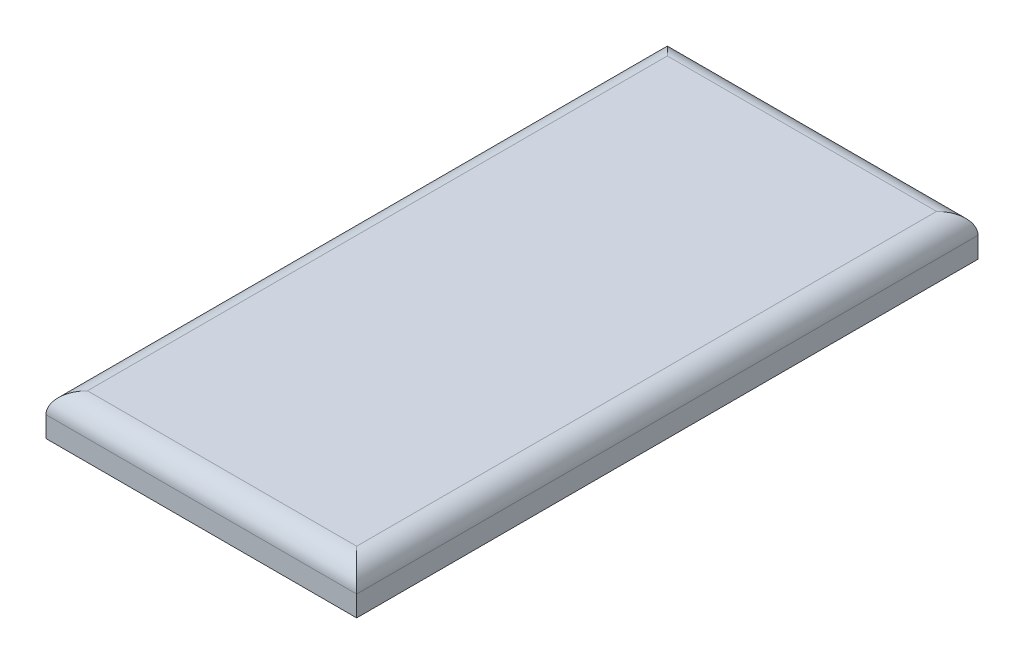
ISO-10303-21;
HEADER;
FILE_DESCRIPTION(('STEP AP214'),'2;1');
FILE_NAME('part.step','',(''),(''),'','','');
FILE_SCHEMA(('AUTOMOTIVE_DESIGN { 1 0 10303 214 1 1 1 1 }'));
ENDSEC;
DATA;
#1=APPLICATION_CONTEXT('core data for automotive mechanical design processes');
#2=APPLICATION_PROTOCOL_DEFINITION('international standard','automotive_design',2000,#1);
#3=PRODUCT_CONTEXT('',#1,'mechanical');
#4=PRODUCT('Part','Part','',(#3));
#5=PRODUCT_RELATED_PRODUCT_CATEGORY('part','',(#4));
#6=PRODUCT_DEFINITION_FORMATION('','',#4);
#7=PRODUCT_DEFINITION_CONTEXT('part definition',#1,'design');
#8=PRODUCT_DEFINITION('design','',#6,#7);
#9=PRODUCT_DEFINITION_SHAPE('','',#8);
#10=(LENGTH_UNIT() NAMED_UNIT(*) SI_UNIT(.MILLI.,.METRE.));
#11=(NAMED_UNIT(*) PLANE_ANGLE_UNIT() SI_UNIT($,.RADIAN.));
#12=(NAMED_UNIT(*) SI_UNIT($,.STERADIAN.) SOLID_ANGLE_UNIT());
#13=UNCERTAINTY_MEASURE_WITH_UNIT(LENGTH_MEASURE(1.E-05),#10,'distance_accuracy_value','');
#14=(GEOMETRIC_REPRESENTATION_CONTEXT(3) GLOBAL_UNCERTAINTY_ASSIGNED_CONTEXT((#13)) GLOBAL_UNIT_ASSIGNED_CONTEXT((#10,
#11,#12)) REPRESENTATION_CONTEXT('',''));
#15=CARTESIAN_POINT('',(0.,0.,0.));
#16=DIRECTION('',(0.,0.,1.));
#17=DIRECTION('',(1.,0.,0.));
#18=AXIS2_PLACEMENT_3D('',#15,#16,#17);
#19=CARTESIAN_POINT('',(75.,20.,150.));
#20=DIRECTION('',(-1.,0.,0.));
#21=DIRECTION('',(0.,0.,1.));
#22=AXIS2_PLACEMENT_3D('',#19,#20,#21);
#23=PLANE('',#22);
#24=DIRECTION('',(0.,-1.,0.));
#25=VECTOR('',#24,1.);
#26=CARTESIAN_POINT('',(75.,20.,-150.));
#27=LINE('',#26,#25);
#28=CARTESIAN_POINT('',(75.,10.,-150.));
#29=VERTEX_POINT('',#28);
#30=CARTESIAN_POINT('',(75.,0.,-150.));
#31=VERTEX_POINT('',#30);
#32=EDGE_CURVE('E88',#29,#31,#27,.T.);
#33=ORIENTED_EDGE('',*,*,#32,.F.);
#34=DIRECTION('',(0.,0.,-1.));
#35=VECTOR('',#34,1.);
#36=CARTESIAN_POINT('',(75.,10.,150.));
#37=LINE('',#36,#35);
#38=CARTESIAN_POINT('',(75.,10.,150.));
#39=VERTEX_POINT('',#38);
#40=EDGE_CURVE('E11',#29,#39,#37,.F.);
#41=ORIENTED_EDGE('',*,*,#40,.T.);
#42=DIRECTION('',(0.,-1.,0.));
#43=VECTOR('',#42,1.);
#44=CARTESIAN_POINT('',(75.,20.,150.));
#45=LINE('',#44,#43);
#46=CARTESIAN_POINT('',(75.,0.,150.));
#47=VERTEX_POINT('',#46);
#48=EDGE_CURVE('E108',#39,#47,#45,.T.);
#49=ORIENTED_EDGE('',*,*,#48,.T.);
#50=DIRECTION('',(0.,0.,-1.));
#51=VECTOR('',#50,1.);
#52=CARTESIAN_POINT('',(75.,0.,150.));
#53=LINE('',#52,#51);
#54=EDGE_CURVE('E103',#47,#31,#53,.T.);
#55=ORIENTED_EDGE('',*,*,#54,.T.);
#56=EDGE_LOOP('',(#33,#41,#49,#55));
#57=FACE_BOUND('',#56,.T.);
#58=ADVANCED_FACE('F36',(#57),#23,.F.);
#59=CARTESIAN_POINT('',(-75.,20.,-150.));
#60=DIRECTION('',(0.,0.,1.));
#61=DIRECTION('',(1.,0.,0.));
#62=AXIS2_PLACEMENT_3D('',#59,#60,#61);
#63=PLANE('',#62);
#64=DIRECTION('',(0.,-1.,0.));
#65=VECTOR('',#64,1.);
#66=CARTESIAN_POINT('',(-75.,20.,-150.));
#67=LINE('',#66,#65);
#68=CARTESIAN_POINT('',(-75.,10.,-150.));
#69=VERTEX_POINT('',#68);
#70=CARTESIAN_POINT('',(-75.,0.,-150.));
#71=VERTEX_POINT('',#70);
#72=EDGE_CURVE('E97',#69,#71,#67,.T.);
#73=ORIENTED_EDGE('',*,*,#72,.F.);
#74=DIRECTION('',(-1.,0.,0.));
#75=VECTOR('',#74,1.);
#76=CARTESIAN_POINT('',(-75.,10.,-150.));
#77=LINE('',#76,#75);
#78=EDGE_CURVE('E45',#69,#29,#77,.F.);
#79=ORIENTED_EDGE('',*,*,#78,.T.);
#80=ORIENTED_EDGE('',*,*,#32,.T.);
#81=DIRECTION('',(-1.,0.,0.));
#82=VECTOR('',#81,1.);
#83=CARTESIAN_POINT('',(-75.,0.,-150.));
#84=LINE('',#83,#82);
#85=EDGE_CURVE('E91',#31,#71,#84,.T.);
#86=ORIENTED_EDGE('',*,*,#85,.T.);
#87=EDGE_LOOP('',(#73,#79,#80,#86));
#88=FACE_BOUND('',#87,.T.);
#89=ADVANCED_FACE('F90',(#88),#63,.F.);
#90=CARTESIAN_POINT('',(-75.,20.,150.));
#91=DIRECTION('',(1.,0.,0.));
#92=DIRECTION('',(0.,0.,-1.));
#93=AXIS2_PLACEMENT_3D('',#90,#91,#92);
#94=PLANE('',#93);
#95=DIRECTION('',(0.,-1.,0.));
#96=VECTOR('',#95,1.);
#97=CARTESIAN_POINT('',(-75.,20.,150.));
#98=LINE('',#97,#96);
#99=CARTESIAN_POINT('',(-75.,10.,150.));
#100=VERTEX_POINT('',#99);
#101=CARTESIAN_POINT('',(-75.,0.,150.));
#102=VERTEX_POINT('',#101);
#103=EDGE_CURVE('E118',#100,#102,#98,.T.);
#104=ORIENTED_EDGE('',*,*,#103,.F.);
#105=DIRECTION('',(0.,0.,1.));
#106=VECTOR('',#105,1.);
#107=CARTESIAN_POINT('',(-75.,10.,150.));
#108=LINE('',#107,#106);
#109=EDGE_CURVE('E60',#100,#69,#108,.F.);
#110=ORIENTED_EDGE('',*,*,#109,.T.);
#111=ORIENTED_EDGE('',*,*,#72,.T.);
#112=DIRECTION('',(0.,0.,1.));
#113=VECTOR('',#112,1.);
#114=CARTESIAN_POINT('',(-75.,0.,150.));
#115=LINE('',#114,#113);
#116=EDGE_CURVE('E105',#71,#102,#115,.T.);
#117=ORIENTED_EDGE('',*,*,#116,.T.);
#118=EDGE_LOOP('',(#104,#110,#111,#117));
#119=FACE_BOUND('',#118,.T.);
#120=ADVANCED_FACE('F156',(#119),#94,.F.);
#121=CARTESIAN_POINT('',(-75.,20.,150.));
#122=DIRECTION('',(0.,0.,-1.));
#123=DIRECTION('',(-1.,0.,0.));
#124=AXIS2_PLACEMENT_3D('',#121,#122,#123);
#125=PLANE('',#124);
#126=ORIENTED_EDGE('',*,*,#48,.F.);
#127=DIRECTION('',(1.,0.,0.));
#128=VECTOR('',#127,1.);
#129=CARTESIAN_POINT('',(-75.,10.,150.));
#130=LINE('',#129,#128);
#131=EDGE_CURVE('E129',#39,#100,#130,.F.);
#132=ORIENTED_EDGE('',*,*,#131,.T.);
#133=ORIENTED_EDGE('',*,*,#103,.T.);
#134=DIRECTION('',(1.,0.,0.));
#135=VECTOR('',#134,1.);
#136=CARTESIAN_POINT('',(-75.,0.,150.));
#137=LINE('',#136,#135);
#138=EDGE_CURVE('E115',#102,#47,#137,.T.);
#139=ORIENTED_EDGE('',*,*,#138,.T.);
#140=EDGE_LOOP('',(#126,#132,#133,#139));
#141=FACE_BOUND('',#140,.T.);
#142=ADVANCED_FACE('F155',(#141),#125,.F.);
#143=CARTESIAN_POINT('',(0.,20.,0.));
#144=DIRECTION('',(0.,-1.,0.));
#145=DIRECTION('',(0.,0.,-1.));
#146=AXIS2_PLACEMENT_3D('',#143,#144,#145);
#147=PLANE('',#146);
#148=DIRECTION('',(0.,0.,1.));
#149=VECTOR('',#148,1.);
#150=CARTESIAN_POINT('',(-65.,20.,0.));
#151=LINE('',#150,#149);
#152=CARTESIAN_POINT('',(-65.,20.,-140.));
#153=VERTEX_POINT('',#152);
#154=CARTESIAN_POINT('',(-65.,20.,140.));
#155=VERTEX_POINT('',#154);
#156=EDGE_CURVE('E124',#153,#155,#151,.T.);
#157=ORIENTED_EDGE('',*,*,#156,.T.);
#158=DIRECTION('',(1.,0.,0.));
#159=VECTOR('',#158,1.);
#160=CARTESIAN_POINT('',(0.,20.,140.));
#161=LINE('',#160,#159);
#162=CARTESIAN_POINT('',(65.,20.,140.));
#163=VERTEX_POINT('',#162);
#164=EDGE_CURVE('E126',#155,#163,#161,.T.);
#165=ORIENTED_EDGE('',*,*,#164,.T.);
#166=DIRECTION('',(0.,0.,-1.));
#167=VECTOR('',#166,1.);
#168=CARTESIAN_POINT('',(65.,20.,0.));
#169=LINE('',#168,#167);
#170=CARTESIAN_POINT('',(65.,20.,-140.));
#171=VERTEX_POINT('',#170);
#172=EDGE_CURVE('E96',#163,#171,#169,.T.);
#173=ORIENTED_EDGE('',*,*,#172,.T.);
#174=DIRECTION('',(-1.,0.,0.));
#175=VECTOR('',#174,1.);
#176=CARTESIAN_POINT('',(0.,20.,-140.));
#177=LINE('',#176,#175);
#178=EDGE_CURVE('E122',#171,#153,#177,.T.);
#179=ORIENTED_EDGE('',*,*,#178,.T.);
#180=EDGE_LOOP('',(#157,#165,#173,#179));
#181=FACE_BOUND('',#180,.T.);
#182=ADVANCED_FACE('F148',(#181),#147,.F.);
#183=CARTESIAN_POINT('',(0.,0.,0.));
#184=DIRECTION('',(0.,-1.,0.));
#185=DIRECTION('',(0.,0.,-1.));
#186=AXIS2_PLACEMENT_3D('',#183,#184,#185);
#187=PLANE('',#186);
#188=ORIENTED_EDGE('',*,*,#54,.F.);
#189=ORIENTED_EDGE('',*,*,#138,.F.);
#190=ORIENTED_EDGE('',*,*,#116,.F.);
#191=ORIENTED_EDGE('',*,*,#85,.F.);
#192=EDGE_LOOP('',(#188,#189,#190,#191));
#193=FACE_BOUND('',#192,.T.);
#194=ADVANCED_FACE('F101',(#193),#187,.T.);
#195=CARTESIAN_POINT('',(0.,10.,-140.));
#196=DIRECTION('',(-1.,0.,0.));
#197=DIRECTION('',(0.,0.,1.));
#198=AXIS2_PLACEMENT_3D('',#195,#196,#197);
#199=CYLINDRICAL_SURFACE('',#198,10.);
#200=CARTESIAN_POINT('',(65.,10.,-140.));
#201=DIRECTION('',(-0.707106781186547,0.,-0.707106781186547));
#202=DIRECTION('',(0.707106781186547,0.,-0.707106781186547));
#203=AXIS2_PLACEMENT_3D('',#200,#201,#202);
#204=ELLIPSE('',#203,14.1421356237309,10.);
#205=EDGE_CURVE('E112',#29,#171,#204,.F.);
#206=ORIENTED_EDGE('',*,*,#205,.F.);
#207=ORIENTED_EDGE('',*,*,#78,.F.);
#208=CARTESIAN_POINT('',(-65.,10.,-140.));
#209=DIRECTION('',(-0.707106781186547,0.,0.707106781186547));
#210=DIRECTION('',(-0.707106781186547,0.,-0.707106781186547));
#211=AXIS2_PLACEMENT_3D('',#208,#209,#210);
#212=ELLIPSE('',#211,14.1421356237309,10.);
#213=EDGE_CURVE('E40',#153,#69,#212,.T.);
#214=ORIENTED_EDGE('',*,*,#213,.F.);
#215=ORIENTED_EDGE('',*,*,#178,.F.);
#216=EDGE_LOOP('',(#206,#207,#214,#215));
#217=FACE_BOUND('',#216,.T.);
#218=ADVANCED_FACE('F38',(#217),#199,.T.);
#219=CARTESIAN_POINT('',(-65.,10.,0.));
#220=DIRECTION('',(0.,0.,1.));
#221=DIRECTION('',(1.,0.,0.));
#222=AXIS2_PLACEMENT_3D('',#219,#220,#221);
#223=CYLINDRICAL_SURFACE('',#222,10.);
#224=ORIENTED_EDGE('',*,*,#213,.T.);
#225=ORIENTED_EDGE('',*,*,#109,.F.);
#226=CARTESIAN_POINT('',(-65.,10.,140.));
#227=DIRECTION('',(0.707106781186547,0.,0.707106781186547));
#228=DIRECTION('',(-0.707106781186547,0.,0.707106781186547));
#229=AXIS2_PLACEMENT_3D('',#226,#227,#228);
#230=ELLIPSE('',#229,14.1421356237309,10.);
#231=EDGE_CURVE('E136',#155,#100,#230,.T.);
#232=ORIENTED_EDGE('',*,*,#231,.F.);
#233=ORIENTED_EDGE('',*,*,#156,.F.);
#234=EDGE_LOOP('',(#224,#225,#232,#233));
#235=FACE_BOUND('',#234,.T.);
#236=ADVANCED_FACE('F173',(#235),#223,.T.);
#237=CARTESIAN_POINT('',(65.,10.,0.));
#238=DIRECTION('',(0.,0.,-1.));
#239=DIRECTION('',(-1.,0.,0.));
#240=AXIS2_PLACEMENT_3D('',#237,#238,#239);
#241=CYLINDRICAL_SURFACE('',#240,10.);
#242=ORIENTED_EDGE('',*,*,#205,.T.);
#243=ORIENTED_EDGE('',*,*,#172,.F.);
#244=CARTESIAN_POINT('',(65.,10.,140.));
#245=DIRECTION('',(0.707106781186547,0.,-0.707106781186547));
#246=DIRECTION('',(-0.707106781186547,0.,-0.707106781186547));
#247=AXIS2_PLACEMENT_3D('',#244,#245,#246);
#248=ELLIPSE('',#247,14.1421356237309,10.);
#249=EDGE_CURVE('E134',#39,#163,#248,.F.);
#250=ORIENTED_EDGE('',*,*,#249,.F.);
#251=ORIENTED_EDGE('',*,*,#40,.F.);
#252=EDGE_LOOP('',(#242,#243,#250,#251));
#253=FACE_BOUND('',#252,.T.);
#254=ADVANCED_FACE('F141',(#253),#241,.T.);
#255=CARTESIAN_POINT('',(0.,10.,140.));
#256=DIRECTION('',(1.,0.,0.));
#257=DIRECTION('',(0.,0.,-1.));
#258=AXIS2_PLACEMENT_3D('',#255,#256,#257);
#259=CYLINDRICAL_SURFACE('',#258,10.);
#260=ORIENTED_EDGE('',*,*,#231,.T.);
#261=ORIENTED_EDGE('',*,*,#131,.F.);
#262=ORIENTED_EDGE('',*,*,#249,.T.);
#263=ORIENTED_EDGE('',*,*,#164,.F.);
#264=EDGE_LOOP('',(#260,#261,#262,#263));
#265=FACE_BOUND('',#264,.T.);
#266=ADVANCED_FACE('F152',(#265),#259,.T.);
#267=CLOSED_SHELL('',(#58,#89,#120,#142,#182,#194,#218,#236,#254,#266));
#268=MANIFOLD_SOLID_BREP('B2',#267);
#269=ADVANCED_BREP_SHAPE_REPRESENTATION('',(#18,#268),#14);
#270=SHAPE_DEFINITION_REPRESENTATION(#9,#269);
ENDSEC;
END-ISO-10303-21;
